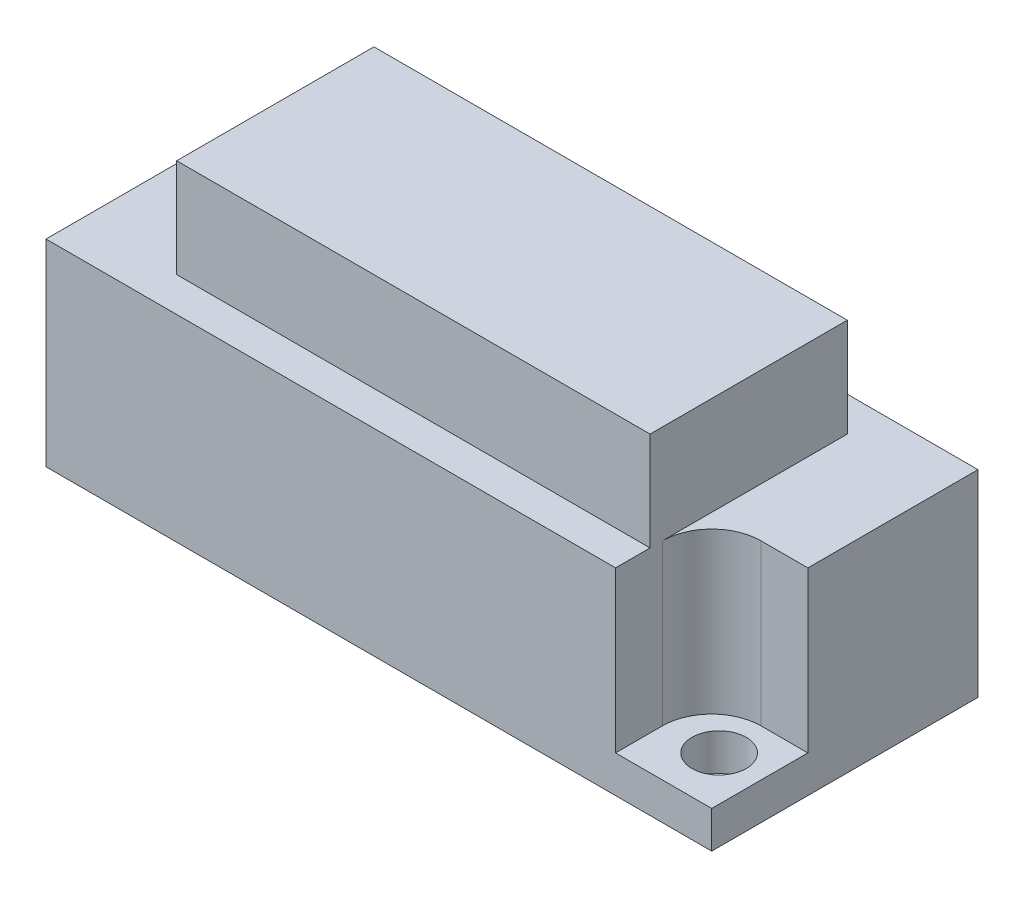
ISO-10303-21;
HEADER;
FILE_DESCRIPTION(('STEP AP214'),'2;1');
FILE_NAME('part.step','',(''),(''),'','','');
FILE_SCHEMA(('AUTOMOTIVE_DESIGN { 1 0 10303 214 1 1 1 1 }'));
ENDSEC;
DATA;
#1=APPLICATION_CONTEXT('core data for automotive mechanical design processes');
#2=APPLICATION_PROTOCOL_DEFINITION('international standard','automotive_design',2000,#1);
#3=PRODUCT_CONTEXT('',#1,'mechanical');
#4=PRODUCT('Part','Part','',(#3));
#5=PRODUCT_RELATED_PRODUCT_CATEGORY('part','',(#4));
#6=PRODUCT_DEFINITION_FORMATION('','',#4);
#7=PRODUCT_DEFINITION_CONTEXT('part definition',#1,'design');
#8=PRODUCT_DEFINITION('design','',#6,#7);
#9=PRODUCT_DEFINITION_SHAPE('','',#8);
#10=(LENGTH_UNIT() NAMED_UNIT(*) SI_UNIT(.MILLI.,.METRE.));
#11=(NAMED_UNIT(*) PLANE_ANGLE_UNIT() SI_UNIT($,.RADIAN.));
#12=(NAMED_UNIT(*) SI_UNIT($,.STERADIAN.) SOLID_ANGLE_UNIT());
#13=UNCERTAINTY_MEASURE_WITH_UNIT(LENGTH_MEASURE(1.E-05),#10,'distance_accuracy_value','');
#14=(GEOMETRIC_REPRESENTATION_CONTEXT(3) GLOBAL_UNCERTAINTY_ASSIGNED_CONTEXT((#13)) GLOBAL_UNIT_ASSIGNED_CONTEXT((#10,
#11,#12)) REPRESENTATION_CONTEXT('',''));
#15=CARTESIAN_POINT('',(0.,0.,0.));
#16=DIRECTION('',(0.,0.,1.));
#17=DIRECTION('',(1.,0.,0.));
#18=AXIS2_PLACEMENT_3D('',#15,#16,#17);
#19=CARTESIAN_POINT('',(-13.5,12.,-5.4));
#20=DIRECTION('',(1.,0.,0.));
#21=DIRECTION('',(0.,0.,-1.));
#22=AXIS2_PLACEMENT_3D('',#19,#20,#21);
#23=PLANE('',#22);
#24=DIRECTION('',(0.,0.,1.));
#25=VECTOR('',#24,1.);
#26=CARTESIAN_POINT('',(-13.5,8.,-5.4));
#27=LINE('',#26,#25);
#28=CARTESIAN_POINT('',(-13.5,8.,-1.5));
#29=VERTEX_POINT('',#28);
#30=CARTESIAN_POINT('',(-13.5,8.,5.4));
#31=VERTEX_POINT('',#30);
#32=EDGE_CURVE('E183',#29,#31,#27,.T.);
#33=ORIENTED_EDGE('',*,*,#32,.F.);
#34=DIRECTION('',(0.,1.,0.));
#35=VECTOR('',#34,1.);
#36=CARTESIAN_POINT('',(-13.5,1.5,-1.5));
#37=LINE('',#36,#35);
#38=CARTESIAN_POINT('',(-13.5,1.5,-1.5));
#39=VERTEX_POINT('',#38);
#40=EDGE_CURVE('E241',#39,#29,#37,.T.);
#41=ORIENTED_EDGE('',*,*,#40,.F.);
#42=DIRECTION('',(0.,0.,1.));
#43=VECTOR('',#42,1.);
#44=CARTESIAN_POINT('',(-13.5,1.5,-5.4));
#45=LINE('',#44,#43);
#46=CARTESIAN_POINT('',(-13.5,1.5,-5.4));
#47=VERTEX_POINT('',#46);
#48=EDGE_CURVE('E232',#47,#39,#45,.T.);
#49=ORIENTED_EDGE('',*,*,#48,.F.);
#50=DIRECTION('',(0.,-1.,0.));
#51=VECTOR('',#50,1.);
#52=CARTESIAN_POINT('',(-13.5,12.,-5.4));
#53=LINE('',#52,#51);
#54=CARTESIAN_POINT('',(-13.5,0.,-5.4));
#55=VERTEX_POINT('',#54);
#56=EDGE_CURVE('E260',#47,#55,#53,.T.);
#57=ORIENTED_EDGE('',*,*,#56,.T.);
#58=DIRECTION('',(0.,0.,1.));
#59=VECTOR('',#58,1.);
#60=CARTESIAN_POINT('',(-13.5,0.,-5.4));
#61=LINE('',#60,#59);
#62=CARTESIAN_POINT('',(-13.5,0.,5.4));
#63=VERTEX_POINT('',#62);
#64=EDGE_CURVE('E246',#55,#63,#61,.T.);
#65=ORIENTED_EDGE('',*,*,#64,.T.);
#66=DIRECTION('',(0.,-1.,0.));
#67=VECTOR('',#66,1.);
#68=CARTESIAN_POINT('',(-13.5,12.,5.4));
#69=LINE('',#68,#67);
#70=EDGE_CURVE('E266',#31,#63,#69,.T.);
#71=ORIENTED_EDGE('',*,*,#70,.F.);
#72=EDGE_LOOP('',(#33,#41,#49,#57,#65,#71));
#73=FACE_BOUND('',#72,.T.);
#74=ADVANCED_FACE('F33',(#73),#23,.F.);
#75=CARTESIAN_POINT('',(-13.5,12.,5.4));
#76=DIRECTION('',(0.,0.,-1.));
#77=DIRECTION('',(-1.,0.,0.));
#78=AXIS2_PLACEMENT_3D('',#75,#76,#77);
#79=PLANE('',#78);
#80=DIRECTION('',(1.,0.,0.));
#81=VECTOR('',#80,1.);
#82=CARTESIAN_POINT('',(-13.5,8.,5.4));
#83=LINE('',#82,#81);
#84=CARTESIAN_POINT('',(9.6,8.,5.4));
#85=VERTEX_POINT('',#84);
#86=EDGE_CURVE('E189',#31,#85,#83,.T.);
#87=ORIENTED_EDGE('',*,*,#86,.F.);
#88=ORIENTED_EDGE('',*,*,#70,.T.);
#89=DIRECTION('',(1.,0.,0.));
#90=VECTOR('',#89,1.);
#91=CARTESIAN_POINT('',(-13.5,0.,5.4));
#92=LINE('',#91,#90);
#93=CARTESIAN_POINT('',(13.5,0.,5.4));
#94=VERTEX_POINT('',#93);
#95=EDGE_CURVE('E251',#63,#94,#92,.T.);
#96=ORIENTED_EDGE('',*,*,#95,.T.);
#97=DIRECTION('',(0.,-1.,0.));
#98=VECTOR('',#97,1.);
#99=CARTESIAN_POINT('',(13.5,12.,5.4));
#100=LINE('',#99,#98);
#101=CARTESIAN_POINT('',(13.5,1.5,5.4));
#102=VERTEX_POINT('',#101);
#103=EDGE_CURVE('E264',#102,#94,#100,.T.);
#104=ORIENTED_EDGE('',*,*,#103,.F.);
#105=DIRECTION('',(1.,0.,0.));
#106=VECTOR('',#105,1.);
#107=CARTESIAN_POINT('',(13.5,1.5,5.4));
#108=LINE('',#107,#106);
#109=CARTESIAN_POINT('',(9.6,1.5,5.4));
#110=VERTEX_POINT('',#109);
#111=EDGE_CURVE('E221',#110,#102,#108,.T.);
#112=ORIENTED_EDGE('',*,*,#111,.F.);
#113=DIRECTION('',(0.,1.,0.));
#114=VECTOR('',#113,1.);
#115=CARTESIAN_POINT('',(9.6,1.5,5.4));
#116=LINE('',#115,#114);
#117=EDGE_CURVE('E226',#110,#85,#116,.T.);
#118=ORIENTED_EDGE('',*,*,#117,.T.);
#119=EDGE_LOOP('',(#87,#88,#96,#104,#112,#118));
#120=FACE_BOUND('',#119,.T.);
#121=ADVANCED_FACE('F311',(#120),#79,.F.);
#122=CARTESIAN_POINT('',(13.5,12.,-5.4));
#123=DIRECTION('',(-1.,0.,0.));
#124=DIRECTION('',(0.,0.,1.));
#125=AXIS2_PLACEMENT_3D('',#122,#123,#124);
#126=PLANE('',#125);
#127=DIRECTION('',(0.,0.,-1.));
#128=VECTOR('',#127,1.);
#129=CARTESIAN_POINT('',(13.5,8.,-5.4));
#130=LINE('',#129,#128);
#131=CARTESIAN_POINT('',(13.5,8.,1.5));
#132=VERTEX_POINT('',#131);
#133=CARTESIAN_POINT('',(13.5,8.,-5.4));
#134=VERTEX_POINT('',#133);
#135=EDGE_CURVE('E191',#132,#134,#130,.T.);
#136=ORIENTED_EDGE('',*,*,#135,.F.);
#137=DIRECTION('',(0.,1.,0.));
#138=VECTOR('',#137,1.);
#139=CARTESIAN_POINT('',(13.5,1.5,1.5));
#140=LINE('',#139,#138);
#141=CARTESIAN_POINT('',(13.5,1.5,1.5));
#142=VERTEX_POINT('',#141);
#143=EDGE_CURVE('E223',#142,#132,#140,.T.);
#144=ORIENTED_EDGE('',*,*,#143,.F.);
#145=DIRECTION('',(0.,0.,-1.));
#146=VECTOR('',#145,1.);
#147=CARTESIAN_POINT('',(13.5,1.5,5.4));
#148=LINE('',#147,#146);
#149=EDGE_CURVE('E213',#102,#142,#148,.T.);
#150=ORIENTED_EDGE('',*,*,#149,.F.);
#151=ORIENTED_EDGE('',*,*,#103,.T.);
#152=DIRECTION('',(0.,0.,-1.));
#153=VECTOR('',#152,1.);
#154=CARTESIAN_POINT('',(13.5,0.,-5.4));
#155=LINE('',#154,#153);
#156=CARTESIAN_POINT('',(13.5,0.,-5.4));
#157=VERTEX_POINT('',#156);
#158=EDGE_CURVE('E254',#94,#157,#155,.T.);
#159=ORIENTED_EDGE('',*,*,#158,.T.);
#160=DIRECTION('',(0.,-1.,0.));
#161=VECTOR('',#160,1.);
#162=CARTESIAN_POINT('',(13.5,12.,-5.4));
#163=LINE('',#162,#161);
#164=EDGE_CURVE('E262',#134,#157,#163,.T.);
#165=ORIENTED_EDGE('',*,*,#164,.F.);
#166=EDGE_LOOP('',(#136,#144,#150,#151,#159,#165));
#167=FACE_BOUND('',#166,.T.);
#168=ADVANCED_FACE('F309',(#167),#126,.F.);
#169=CARTESIAN_POINT('',(-13.5,12.,-5.4));
#170=DIRECTION('',(0.,0.,1.));
#171=DIRECTION('',(1.,0.,0.));
#172=AXIS2_PLACEMENT_3D('',#169,#170,#171);
#173=PLANE('',#172);
#174=DIRECTION('',(-1.,0.,0.));
#175=VECTOR('',#174,1.);
#176=CARTESIAN_POINT('',(-13.5,8.,-5.4));
#177=LINE('',#176,#175);
#178=CARTESIAN_POINT('',(-9.6,8.,-5.4));
#179=VERTEX_POINT('',#178);
#180=EDGE_CURVE('E193',#134,#179,#177,.T.);
#181=ORIENTED_EDGE('',*,*,#180,.F.);
#182=ORIENTED_EDGE('',*,*,#164,.T.);
#183=DIRECTION('',(-1.,0.,0.));
#184=VECTOR('',#183,1.);
#185=CARTESIAN_POINT('',(-13.5,0.,-5.4));
#186=LINE('',#185,#184);
#187=EDGE_CURVE('E257',#157,#55,#186,.T.);
#188=ORIENTED_EDGE('',*,*,#187,.T.);
#189=ORIENTED_EDGE('',*,*,#56,.F.);
#190=DIRECTION('',(-1.,0.,0.));
#191=VECTOR('',#190,1.);
#192=CARTESIAN_POINT('',(-13.5,1.5,-5.4));
#193=LINE('',#192,#191);
#194=CARTESIAN_POINT('',(-9.6,1.5,-5.4));
#195=VERTEX_POINT('',#194);
#196=EDGE_CURVE('E239',#195,#47,#193,.T.);
#197=ORIENTED_EDGE('',*,*,#196,.F.);
#198=DIRECTION('',(0.,1.,0.));
#199=VECTOR('',#198,1.);
#200=CARTESIAN_POINT('',(-9.6,1.5,-5.4));
#201=LINE('',#200,#199);
#202=EDGE_CURVE('E243',#195,#179,#201,.T.);
#203=ORIENTED_EDGE('',*,*,#202,.T.);
#204=EDGE_LOOP('',(#181,#182,#188,#189,#197,#203));
#205=FACE_BOUND('',#204,.T.);
#206=ADVANCED_FACE('F322',(#205),#173,.F.);
#207=CARTESIAN_POINT('',(0.,12.,0.));
#208=DIRECTION('',(0.,1.,0.));
#209=DIRECTION('',(0.,0.,1.));
#210=AXIS2_PLACEMENT_3D('',#207,#208,#209);
#211=PLANE('',#210);
#212=DIRECTION('',(0.,0.,1.));
#213=VECTOR('',#212,1.);
#214=CARTESIAN_POINT('',(9.6,12.,5.4));
#215=LINE('',#214,#213);
#216=CARTESIAN_POINT('',(9.6,12.,-4.));
#217=VERTEX_POINT('',#216);
#218=CARTESIAN_POINT('',(9.6,12.,4.));
#219=VERTEX_POINT('',#218);
#220=EDGE_CURVE('E212',#217,#219,#215,.T.);
#221=ORIENTED_EDGE('',*,*,#220,.F.);
#222=DIRECTION('',(-1.,0.,0.));
#223=VECTOR('',#222,1.);
#224=CARTESIAN_POINT('',(-9.6,12.,-4.));
#225=LINE('',#224,#223);
#226=CARTESIAN_POINT('',(-9.6,12.,-4.));
#227=VERTEX_POINT('',#226);
#228=EDGE_CURVE('E158',#217,#227,#225,.T.);
#229=ORIENTED_EDGE('',*,*,#228,.T.);
#230=DIRECTION('',(0.,0.,-1.));
#231=VECTOR('',#230,1.);
#232=CARTESIAN_POINT('',(-9.6,12.,-5.4));
#233=LINE('',#232,#231);
#234=CARTESIAN_POINT('',(-9.6,12.,4.));
#235=VERTEX_POINT('',#234);
#236=EDGE_CURVE('E229',#235,#227,#233,.T.);
#237=ORIENTED_EDGE('',*,*,#236,.F.);
#238=DIRECTION('',(1.,0.,0.));
#239=VECTOR('',#238,1.);
#240=CARTESIAN_POINT('',(-9.6,12.,4.));
#241=LINE('',#240,#239);
#242=EDGE_CURVE('E165',#235,#219,#241,.T.);
#243=ORIENTED_EDGE('',*,*,#242,.T.);
#244=EDGE_LOOP('',(#221,#229,#237,#243));
#245=FACE_BOUND('',#244,.T.);
#246=ADVANCED_FACE('F334',(#245),#211,.T.);
#247=CARTESIAN_POINT('',(-13.5,1.5,-1.5));
#248=DIRECTION('',(0.,0.,1.));
#249=DIRECTION('',(1.,0.,0.));
#250=AXIS2_PLACEMENT_3D('',#247,#248,#249);
#251=PLANE('',#250);
#252=DIRECTION('',(-1.,0.,0.));
#253=VECTOR('',#252,1.);
#254=CARTESIAN_POINT('',(-13.5,8.,-1.5));
#255=LINE('',#254,#253);
#256=CARTESIAN_POINT('',(-11.6,8.,-1.5));
#257=VERTEX_POINT('',#256);
#258=EDGE_CURVE('E195',#257,#29,#255,.T.);
#259=ORIENTED_EDGE('',*,*,#258,.F.);
#260=DIRECTION('',(0.,1.,0.));
#261=VECTOR('',#260,1.);
#262=CARTESIAN_POINT('',(-11.6,1.5,-1.5));
#263=LINE('',#262,#261);
#264=CARTESIAN_POINT('',(-11.6,1.5,-1.5));
#265=VERTEX_POINT('',#264);
#266=EDGE_CURVE('E48',#257,#265,#263,.F.);
#267=ORIENTED_EDGE('',*,*,#266,.T.);
#268=DIRECTION('',(1.,0.,0.));
#269=VECTOR('',#268,1.);
#270=CARTESIAN_POINT('',(-13.5,1.5,-1.5));
#271=LINE('',#270,#269);
#272=EDGE_CURVE('E235',#39,#265,#271,.T.);
#273=ORIENTED_EDGE('',*,*,#272,.F.);
#274=ORIENTED_EDGE('',*,*,#40,.T.);
#275=EDGE_LOOP('',(#259,#267,#273,#274));
#276=FACE_BOUND('',#275,.T.);
#277=ADVANCED_FACE('F338',(#276),#251,.F.);
#278=CARTESIAN_POINT('',(13.5,1.5,1.5));
#279=DIRECTION('',(0.,0.,-1.));
#280=DIRECTION('',(-1.,0.,0.));
#281=AXIS2_PLACEMENT_3D('',#278,#279,#280);
#282=PLANE('',#281);
#283=DIRECTION('',(1.,0.,0.));
#284=VECTOR('',#283,1.);
#285=CARTESIAN_POINT('',(13.5,8.,1.5));
#286=LINE('',#285,#284);
#287=CARTESIAN_POINT('',(11.6,8.,1.5));
#288=VERTEX_POINT('',#287);
#289=EDGE_CURVE('E199',#288,#132,#286,.T.);
#290=ORIENTED_EDGE('',*,*,#289,.F.);
#291=DIRECTION('',(0.,1.,0.));
#292=VECTOR('',#291,1.);
#293=CARTESIAN_POINT('',(11.6,1.5,1.5));
#294=LINE('',#293,#292);
#295=CARTESIAN_POINT('',(11.6,1.5,1.5));
#296=VERTEX_POINT('',#295);
#297=EDGE_CURVE('E271',#288,#296,#294,.F.);
#298=ORIENTED_EDGE('',*,*,#297,.T.);
#299=DIRECTION('',(-1.,0.,0.));
#300=VECTOR('',#299,1.);
#301=CARTESIAN_POINT('',(13.5,1.5,1.5));
#302=LINE('',#301,#300);
#303=EDGE_CURVE('E216',#142,#296,#302,.T.);
#304=ORIENTED_EDGE('',*,*,#303,.F.);
#305=ORIENTED_EDGE('',*,*,#143,.T.);
#306=EDGE_LOOP('',(#290,#298,#304,#305));
#307=FACE_BOUND('',#306,.T.);
#308=ADVANCED_FACE('F336',(#307),#282,.F.);
#309=CARTESIAN_POINT('',(11.6,1.5,3.5));
#310=DIRECTION('',(0.,-1.,0.));
#311=DIRECTION('',(0.,0.,-1.));
#312=AXIS2_PLACEMENT_3D('',#309,#310,#311);
#313=CYLINDRICAL_SURFACE('',#312,2.);
#314=CARTESIAN_POINT('',(11.6,8.,3.5));
#315=DIRECTION('',(0.,1.,0.));
#316=DIRECTION('',(0.,0.,1.));
#317=AXIS2_PLACEMENT_3D('',#314,#315,#316);
#318=CIRCLE('',#317,2.);
#319=CARTESIAN_POINT('',(9.6,8.,3.5));
#320=VERTEX_POINT('',#319);
#321=EDGE_CURVE('E197',#320,#288,#318,.F.);
#322=ORIENTED_EDGE('',*,*,#321,.F.);
#323=DIRECTION('',(0.,1.,0.));
#324=VECTOR('',#323,1.);
#325=CARTESIAN_POINT('',(9.6,12.,3.5));
#326=LINE('',#325,#324);
#327=CARTESIAN_POINT('',(9.6,1.5,3.5));
#328=VERTEX_POINT('',#327);
#329=EDGE_CURVE('E268',#328,#320,#326,.T.);
#330=ORIENTED_EDGE('',*,*,#329,.F.);
#331=CARTESIAN_POINT('',(11.6,1.5,3.5));
#332=DIRECTION('',(0.,1.,0.));
#333=DIRECTION('',(0.,0.,1.));
#334=AXIS2_PLACEMENT_3D('',#331,#332,#333);
#335=CIRCLE('',#334,2.);
#336=EDGE_CURVE('E273',#296,#328,#335,.T.);
#337=ORIENTED_EDGE('',*,*,#336,.F.);
#338=ORIENTED_EDGE('',*,*,#297,.F.);
#339=EDGE_LOOP('',(#322,#330,#337,#338));
#340=FACE_BOUND('',#339,.T.);
#341=ADVANCED_FACE('F300',(#340),#313,.F.);
#342=CARTESIAN_POINT('',(-11.6,1.5,-3.5));
#343=DIRECTION('',(0.,-1.,0.));
#344=DIRECTION('',(0.,0.,-1.));
#345=AXIS2_PLACEMENT_3D('',#342,#343,#344);
#346=CYLINDRICAL_SURFACE('',#345,2.);
#347=CARTESIAN_POINT('',(-11.6,8.,-3.5));
#348=DIRECTION('',(0.,1.,0.));
#349=DIRECTION('',(0.,0.,1.));
#350=AXIS2_PLACEMENT_3D('',#347,#348,#349);
#351=CIRCLE('',#350,2.);
#352=CARTESIAN_POINT('',(-9.6,8.,-3.5));
#353=VERTEX_POINT('',#352);
#354=EDGE_CURVE('E11',#353,#257,#351,.F.);
#355=ORIENTED_EDGE('',*,*,#354,.F.);
#356=DIRECTION('',(0.,1.,0.));
#357=VECTOR('',#356,1.);
#358=CARTESIAN_POINT('',(-9.6,12.,-3.5));
#359=LINE('',#358,#357);
#360=CARTESIAN_POINT('',(-9.6,1.5,-3.5));
#361=VERTEX_POINT('',#360);
#362=EDGE_CURVE('E153',#361,#353,#359,.T.);
#363=ORIENTED_EDGE('',*,*,#362,.F.);
#364=CARTESIAN_POINT('',(-11.6,1.5,-3.5));
#365=DIRECTION('',(0.,1.,0.));
#366=DIRECTION('',(0.,0.,1.));
#367=AXIS2_PLACEMENT_3D('',#364,#365,#366);
#368=CIRCLE('',#367,2.);
#369=EDGE_CURVE('E41',#265,#361,#368,.T.);
#370=ORIENTED_EDGE('',*,*,#369,.F.);
#371=ORIENTED_EDGE('',*,*,#266,.F.);
#372=EDGE_LOOP('',(#355,#363,#370,#371));
#373=FACE_BOUND('',#372,.T.);
#374=ADVANCED_FACE('F35',(#373),#346,.F.);
#375=CARTESIAN_POINT('',(0.,0.,0.));
#376=DIRECTION('',(0.,1.,0.));
#377=DIRECTION('',(0.,0.,1.));
#378=AXIS2_PLACEMENT_3D('',#375,#376,#377);
#379=PLANE('',#378);
#380=CARTESIAN_POINT('',(11.6999999999953,0.,3.29999999999793));
#381=DIRECTION('',(0.,1.,0.));
#382=DIRECTION('',(0.,0.,1.));
#383=AXIS2_PLACEMENT_3D('',#380,#381,#382);
#384=CIRCLE('',#383,1.1);
#385=CARTESIAN_POINT('',(11.6999999999953,0.,4.39999999999793));
#386=VERTEX_POINT('',#385);
#387=EDGE_CURVE('E205',#386,#386,#384,.T.);
#388=ORIENTED_EDGE('',*,*,#387,.T.);
#389=EDGE_LOOP('',(#388));
#390=FACE_BOUND('',#389,.T.);
#391=CARTESIAN_POINT('',(-11.6999999999952,0.,-3.29999999999793));
#392=DIRECTION('',(0.,1.,0.));
#393=DIRECTION('',(0.,0.,1.));
#394=AXIS2_PLACEMENT_3D('',#391,#392,#393);
#395=CIRCLE('',#394,1.1);
#396=CARTESIAN_POINT('',(-11.6999999999952,0.,-2.19999999999793));
#397=VERTEX_POINT('',#396);
#398=EDGE_CURVE('E209',#397,#397,#395,.T.);
#399=ORIENTED_EDGE('',*,*,#398,.T.);
#400=EDGE_LOOP('',(#399));
#401=FACE_BOUND('',#400,.T.);
#402=ORIENTED_EDGE('',*,*,#64,.F.);
#403=ORIENTED_EDGE('',*,*,#187,.F.);
#404=ORIENTED_EDGE('',*,*,#158,.F.);
#405=ORIENTED_EDGE('',*,*,#95,.F.);
#406=EDGE_LOOP('',(#402,#403,#404,#405));
#407=FACE_BOUND('',#406,.T.);
#408=ADVANCED_FACE('F318',(#390,#401,#407),#379,.F.);
#409=CARTESIAN_POINT('',(-9.6,1.5,-5.4));
#410=DIRECTION('',(1.,0.,0.));
#411=DIRECTION('',(0.,0.,-1.));
#412=AXIS2_PLACEMENT_3D('',#409,#410,#411);
#413=PLANE('',#412);
#414=DIRECTION('',(0.,1.,0.));
#415=VECTOR('',#414,1.);
#416=CARTESIAN_POINT('',(-9.6,8.,-4.));
#417=LINE('',#416,#415);
#418=CARTESIAN_POINT('',(-9.6,8.,-4.));
#419=VERTEX_POINT('',#418);
#420=EDGE_CURVE('E181',#419,#227,#417,.T.);
#421=ORIENTED_EDGE('',*,*,#420,.F.);
#422=DIRECTION('',(0.,0.,1.));
#423=VECTOR('',#422,1.);
#424=CARTESIAN_POINT('',(-9.6,8.,-5.4));
#425=LINE('',#424,#423);
#426=EDGE_CURVE('E202',#179,#419,#425,.T.);
#427=ORIENTED_EDGE('',*,*,#426,.F.);
#428=ORIENTED_EDGE('',*,*,#202,.F.);
#429=DIRECTION('',(0.,0.,-1.));
#430=VECTOR('',#429,1.);
#431=CARTESIAN_POINT('',(-9.6,1.5,-5.4));
#432=LINE('',#431,#430);
#433=EDGE_CURVE('E237',#361,#195,#432,.T.);
#434=ORIENTED_EDGE('',*,*,#433,.F.);
#435=ORIENTED_EDGE('',*,*,#362,.T.);
#436=DIRECTION('',(0.,0.,1.));
#437=VECTOR('',#436,1.);
#438=CARTESIAN_POINT('',(-9.6,8.,-4.));
#439=LINE('',#438,#437);
#440=CARTESIAN_POINT('',(-9.6,8.,4.));
#441=VERTEX_POINT('',#440);
#442=EDGE_CURVE('E145',#353,#441,#439,.T.);
#443=ORIENTED_EDGE('',*,*,#442,.T.);
#444=DIRECTION('',(0.,1.,0.));
#445=VECTOR('',#444,1.);
#446=CARTESIAN_POINT('',(-9.6,8.,4.));
#447=LINE('',#446,#445);
#448=EDGE_CURVE('E150',#441,#235,#447,.T.);
#449=ORIENTED_EDGE('',*,*,#448,.T.);
#450=ORIENTED_EDGE('',*,*,#236,.T.);
#451=EDGE_LOOP('',(#421,#427,#428,#434,#435,#443,#449,#450));
#452=FACE_BOUND('',#451,.T.);
#453=ADVANCED_FACE('F148',(#452),#413,.F.);
#454=CARTESIAN_POINT('',(0.,1.5,0.));
#455=DIRECTION('',(0.,1.,0.));
#456=DIRECTION('',(0.,0.,1.));
#457=AXIS2_PLACEMENT_3D('',#454,#455,#456);
#458=PLANE('',#457);
#459=CARTESIAN_POINT('',(-11.6999999999952,1.5,-3.29999999999793));
#460=DIRECTION('',(0.,1.,0.));
#461=DIRECTION('',(0.,0.,1.));
#462=AXIS2_PLACEMENT_3D('',#459,#460,#461);
#463=CIRCLE('',#462,1.1);
#464=CARTESIAN_POINT('',(-11.6999999999952,1.5,-2.19999999999793));
#465=VERTEX_POINT('',#464);
#466=EDGE_CURVE('E208',#465,#465,#463,.T.);
#467=ORIENTED_EDGE('',*,*,#466,.F.);
#468=EDGE_LOOP('',(#467));
#469=FACE_BOUND('',#468,.T.);
#470=ORIENTED_EDGE('',*,*,#272,.T.);
#471=ORIENTED_EDGE('',*,*,#369,.T.);
#472=ORIENTED_EDGE('',*,*,#433,.T.);
#473=ORIENTED_EDGE('',*,*,#196,.T.);
#474=ORIENTED_EDGE('',*,*,#48,.T.);
#475=EDGE_LOOP('',(#470,#471,#472,#473,#474));
#476=FACE_BOUND('',#475,.T.);
#477=ADVANCED_FACE('F366',(#469,#476),#458,.T.);
#478=CARTESIAN_POINT('',(9.6,1.5,5.4));
#479=DIRECTION('',(-1.,0.,0.));
#480=DIRECTION('',(0.,0.,1.));
#481=AXIS2_PLACEMENT_3D('',#478,#479,#480);
#482=PLANE('',#481);
#483=DIRECTION('',(0.,1.,0.));
#484=VECTOR('',#483,1.);
#485=CARTESIAN_POINT('',(9.6,8.,4.));
#486=LINE('',#485,#484);
#487=CARTESIAN_POINT('',(9.6,8.,4.));
#488=VERTEX_POINT('',#487);
#489=EDGE_CURVE('E166',#488,#219,#486,.T.);
#490=ORIENTED_EDGE('',*,*,#489,.F.);
#491=DIRECTION('',(0.,0.,-1.));
#492=VECTOR('',#491,1.);
#493=CARTESIAN_POINT('',(9.6,8.,5.4));
#494=LINE('',#493,#492);
#495=EDGE_CURVE('E171',#85,#488,#494,.T.);
#496=ORIENTED_EDGE('',*,*,#495,.F.);
#497=ORIENTED_EDGE('',*,*,#117,.F.);
#498=DIRECTION('',(0.,0.,1.));
#499=VECTOR('',#498,1.);
#500=CARTESIAN_POINT('',(9.6,1.5,5.4));
#501=LINE('',#500,#499);
#502=EDGE_CURVE('E219',#328,#110,#501,.T.);
#503=ORIENTED_EDGE('',*,*,#502,.F.);
#504=ORIENTED_EDGE('',*,*,#329,.T.);
#505=DIRECTION('',(0.,0.,-1.));
#506=VECTOR('',#505,1.);
#507=CARTESIAN_POINT('',(9.6,8.,-4.));
#508=LINE('',#507,#506);
#509=CARTESIAN_POINT('',(9.6,8.,-4.));
#510=VERTEX_POINT('',#509);
#511=EDGE_CURVE('E172',#320,#510,#508,.T.);
#512=ORIENTED_EDGE('',*,*,#511,.T.);
#513=DIRECTION('',(0.,1.,0.));
#514=VECTOR('',#513,1.);
#515=CARTESIAN_POINT('',(9.6,8.,-4.));
#516=LINE('',#515,#514);
#517=EDGE_CURVE('E184',#510,#217,#516,.T.);
#518=ORIENTED_EDGE('',*,*,#517,.T.);
#519=ORIENTED_EDGE('',*,*,#220,.T.);
#520=EDGE_LOOP('',(#490,#496,#497,#503,#504,#512,#518,#519));
#521=FACE_BOUND('',#520,.T.);
#522=ADVANCED_FACE('F289',(#521),#482,.F.);
#523=CARTESIAN_POINT('',(0.,1.5,0.));
#524=DIRECTION('',(0.,1.,0.));
#525=DIRECTION('',(0.,0.,1.));
#526=AXIS2_PLACEMENT_3D('',#523,#524,#525);
#527=PLANE('',#526);
#528=CARTESIAN_POINT('',(11.6999999999953,1.5,3.29999999999793));
#529=DIRECTION('',(0.,1.,0.));
#530=DIRECTION('',(0.,0.,1.));
#531=AXIS2_PLACEMENT_3D('',#528,#529,#530);
#532=CIRCLE('',#531,1.1);
#533=CARTESIAN_POINT('',(11.6999999999953,1.5,4.39999999999793));
#534=VERTEX_POINT('',#533);
#535=EDGE_CURVE('E204',#534,#534,#532,.T.);
#536=ORIENTED_EDGE('',*,*,#535,.F.);
#537=EDGE_LOOP('',(#536));
#538=FACE_BOUND('',#537,.T.);
#539=ORIENTED_EDGE('',*,*,#303,.T.);
#540=ORIENTED_EDGE('',*,*,#336,.T.);
#541=ORIENTED_EDGE('',*,*,#502,.T.);
#542=ORIENTED_EDGE('',*,*,#111,.T.);
#543=ORIENTED_EDGE('',*,*,#149,.T.);
#544=EDGE_LOOP('',(#539,#540,#541,#542,#543));
#545=FACE_BOUND('',#544,.T.);
#546=ADVANCED_FACE('F285',(#538,#545),#527,.T.);
#547=CARTESIAN_POINT('',(-11.6999999999952,-28.5,-3.29999999999793));
#548=DIRECTION('',(0.,1.,0.));
#549=DIRECTION('',(0.,0.,1.));
#550=AXIS2_PLACEMENT_3D('',#547,#548,#549);
#551=CYLINDRICAL_SURFACE('',#550,1.1);
#552=ORIENTED_EDGE('',*,*,#466,.T.);
#553=EDGE_LOOP('',(#552));
#554=FACE_BOUND('',#553,.T.);
#555=ORIENTED_EDGE('',*,*,#398,.F.);
#556=EDGE_LOOP('',(#555));
#557=FACE_BOUND('',#556,.T.);
#558=ADVANCED_FACE('F288',(#554,#557),#551,.F.);
#559=CARTESIAN_POINT('',(11.6999999999953,-28.5,3.29999999999793));
#560=DIRECTION('',(0.,1.,0.));
#561=DIRECTION('',(0.,0.,1.));
#562=AXIS2_PLACEMENT_3D('',#559,#560,#561);
#563=CYLINDRICAL_SURFACE('',#562,1.1);
#564=ORIENTED_EDGE('',*,*,#535,.T.);
#565=EDGE_LOOP('',(#564));
#566=FACE_BOUND('',#565,.T.);
#567=ORIENTED_EDGE('',*,*,#387,.F.);
#568=EDGE_LOOP('',(#567));
#569=FACE_BOUND('',#568,.T.);
#570=ADVANCED_FACE('F282',(#566,#569),#563,.F.);
#571=CARTESIAN_POINT('',(0.,8.,0.));
#572=DIRECTION('',(0.,1.,0.));
#573=DIRECTION('',(0.,0.,1.));
#574=AXIS2_PLACEMENT_3D('',#571,#572,#573);
#575=PLANE('',#574);
#576=ORIENTED_EDGE('',*,*,#495,.T.);
#577=DIRECTION('',(1.,0.,0.));
#578=VECTOR('',#577,1.);
#579=CARTESIAN_POINT('',(-9.6,8.,4.));
#580=LINE('',#579,#578);
#581=EDGE_CURVE('E157',#441,#488,#580,.T.);
#582=ORIENTED_EDGE('',*,*,#581,.F.);
#583=ORIENTED_EDGE('',*,*,#442,.F.);
#584=ORIENTED_EDGE('',*,*,#354,.T.);
#585=ORIENTED_EDGE('',*,*,#258,.T.);
#586=ORIENTED_EDGE('',*,*,#32,.T.);
#587=ORIENTED_EDGE('',*,*,#86,.T.);
#588=EDGE_LOOP('',(#576,#582,#583,#584,#585,#586,#587));
#589=FACE_BOUND('',#588,.T.);
#590=ADVANCED_FACE('F169',(#589),#575,.T.);
#591=CARTESIAN_POINT('',(-9.6,8.,4.));
#592=DIRECTION('',(0.,0.,1.));
#593=DIRECTION('',(1.,0.,0.));
#594=AXIS2_PLACEMENT_3D('',#591,#592,#593);
#595=PLANE('',#594);
#596=ORIENTED_EDGE('',*,*,#242,.F.);
#597=ORIENTED_EDGE('',*,*,#448,.F.);
#598=ORIENTED_EDGE('',*,*,#581,.T.);
#599=ORIENTED_EDGE('',*,*,#489,.T.);
#600=EDGE_LOOP('',(#596,#597,#598,#599));
#601=FACE_BOUND('',#600,.T.);
#602=ADVANCED_FACE('F162',(#601),#595,.T.);
#603=ORIENTED_EDGE('',*,*,#426,.T.);
#604=DIRECTION('',(-1.,0.,0.));
#605=VECTOR('',#604,1.);
#606=CARTESIAN_POINT('',(-9.6,8.,-4.));
#607=LINE('',#606,#605);
#608=EDGE_CURVE('E167',#510,#419,#607,.T.);
#609=ORIENTED_EDGE('',*,*,#608,.F.);
#610=ORIENTED_EDGE('',*,*,#511,.F.);
#611=ORIENTED_EDGE('',*,*,#321,.T.);
#612=ORIENTED_EDGE('',*,*,#289,.T.);
#613=ORIENTED_EDGE('',*,*,#135,.T.);
#614=ORIENTED_EDGE('',*,*,#180,.T.);
#615=EDGE_LOOP('',(#603,#609,#610,#611,#612,#613,#614));
#616=FACE_BOUND('',#615,.T.);
#617=ADVANCED_FACE('F328',(#616),#575,.T.);
#618=CARTESIAN_POINT('',(-9.6,8.,-4.));
#619=DIRECTION('',(0.,0.,-1.));
#620=DIRECTION('',(-1.,0.,0.));
#621=AXIS2_PLACEMENT_3D('',#618,#619,#620);
#622=PLANE('',#621);
#623=ORIENTED_EDGE('',*,*,#228,.F.);
#624=ORIENTED_EDGE('',*,*,#517,.F.);
#625=ORIENTED_EDGE('',*,*,#608,.T.);
#626=ORIENTED_EDGE('',*,*,#420,.T.);
#627=EDGE_LOOP('',(#623,#624,#625,#626));
#628=FACE_BOUND('',#627,.T.);
#629=ADVANCED_FACE('F332',(#628),#622,.T.);
#630=CLOSED_SHELL('',(#74,#121,#168,#206,#246,#277,#308,#341,#374,#408,#453,#477,#522,#546,#558,
#570,#590,#602,#617,#629));
#631=MANIFOLD_SOLID_BREP('B2',#630);
#632=ADVANCED_BREP_SHAPE_REPRESENTATION('',(#18,#631),#14);
#633=SHAPE_DEFINITION_REPRESENTATION(#9,#632);
ENDSEC;
END-ISO-10303-21;
